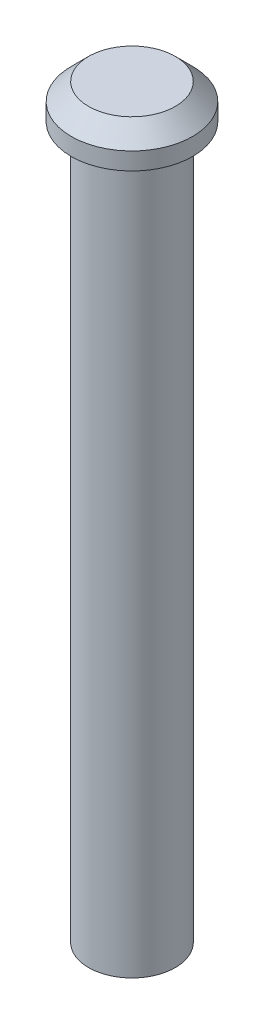
ISO-10303-21;
HEADER;
FILE_DESCRIPTION(('STEP AP214'),'2;1');
FILE_NAME('part.step','',(''),(''),'','','');
FILE_SCHEMA(('AUTOMOTIVE_DESIGN { 1 0 10303 214 1 1 1 1 }'));
ENDSEC;
DATA;
#1=APPLICATION_CONTEXT('core data for automotive mechanical design processes');
#2=APPLICATION_PROTOCOL_DEFINITION('international standard','automotive_design',2000,#1);
#3=PRODUCT_CONTEXT('',#1,'mechanical');
#4=PRODUCT('Part','Part','',(#3));
#5=PRODUCT_RELATED_PRODUCT_CATEGORY('part','',(#4));
#6=PRODUCT_DEFINITION_FORMATION('','',#4);
#7=PRODUCT_DEFINITION_CONTEXT('part definition',#1,'design');
#8=PRODUCT_DEFINITION('design','',#6,#7);
#9=PRODUCT_DEFINITION_SHAPE('','',#8);
#10=(LENGTH_UNIT() NAMED_UNIT(*) SI_UNIT(.MILLI.,.METRE.));
#11=(NAMED_UNIT(*) PLANE_ANGLE_UNIT() SI_UNIT($,.RADIAN.));
#12=(NAMED_UNIT(*) SI_UNIT($,.STERADIAN.) SOLID_ANGLE_UNIT());
#13=UNCERTAINTY_MEASURE_WITH_UNIT(LENGTH_MEASURE(1.E-05),#10,'distance_accuracy_value','');
#14=(GEOMETRIC_REPRESENTATION_CONTEXT(3) GLOBAL_UNCERTAINTY_ASSIGNED_CONTEXT((#13)) GLOBAL_UNIT_ASSIGNED_CONTEXT((#10,
#11,#12)) REPRESENTATION_CONTEXT('',''));
#15=CARTESIAN_POINT('',(0.,0.,0.));
#16=DIRECTION('',(0.,0.,1.));
#17=DIRECTION('',(1.,0.,0.));
#18=AXIS2_PLACEMENT_3D('',#15,#16,#17);
#19=CARTESIAN_POINT('',(0.,41.,0.));
#20=DIRECTION('',(0.,-1.,0.));
#21=DIRECTION('',(0.,0.,-1.));
#22=AXIS2_PLACEMENT_3D('',#19,#20,#21);
#23=CYLINDRICAL_SURFACE('',#22,2.5);
#24=CARTESIAN_POINT('',(0.,41.,0.));
#25=DIRECTION('',(0.,1.,0.));
#26=DIRECTION('',(0.,0.,1.));
#27=AXIS2_PLACEMENT_3D('',#24,#25,#26);
#28=CIRCLE('',#27,2.5);
#29=CARTESIAN_POINT('',(0.,41.,2.5));
#30=VERTEX_POINT('',#29);
#31=EDGE_CURVE('E53',#30,#30,#28,.T.);
#32=ORIENTED_EDGE('',*,*,#31,.F.);
#33=EDGE_LOOP('',(#32));
#34=FACE_BOUND('',#33,.T.);
#35=CARTESIAN_POINT('',(0.,0.,0.));
#36=DIRECTION('',(0.,1.,0.));
#37=DIRECTION('',(0.,0.,1.));
#38=AXIS2_PLACEMENT_3D('',#35,#36,#37);
#39=CIRCLE('',#38,2.5);
#40=CARTESIAN_POINT('',(0.,0.,2.5));
#41=VERTEX_POINT('',#40);
#42=EDGE_CURVE('E58',#41,#41,#39,.T.);
#43=ORIENTED_EDGE('',*,*,#42,.T.);
#44=EDGE_LOOP('',(#43));
#45=FACE_BOUND('',#44,.T.);
#46=ADVANCED_FACE('F39',(#34,#45),#23,.T.);
#47=CARTESIAN_POINT('',(0.,0.,0.));
#48=DIRECTION('',(0.,1.,0.));
#49=DIRECTION('',(0.,0.,1.));
#50=AXIS2_PLACEMENT_3D('',#47,#48,#49);
#51=PLANE('',#50);
#52=CARTESIAN_POINT('',(0.,0.,0.));
#53=DIRECTION('',(0.,-1.,0.));
#54=DIRECTION('',(0.,0.,-1.));
#55=AXIS2_PLACEMENT_3D('',#52,#53,#54);
#56=CIRCLE('',#55,1.5);
#57=CARTESIAN_POINT('',(0.,0.,-1.5));
#58=VERTEX_POINT('',#57);
#59=EDGE_CURVE('E69',#58,#58,#56,.T.);
#60=ORIENTED_EDGE('',*,*,#59,.F.);
#61=EDGE_LOOP('',(#60));
#62=FACE_BOUND('',#61,.T.);
#63=ORIENTED_EDGE('',*,*,#42,.F.);
#64=EDGE_LOOP('',(#63));
#65=FACE_BOUND('',#64,.T.);
#66=ADVANCED_FACE('F85',(#62,#65),#51,.F.);
#67=CARTESIAN_POINT('',(0.,43.,0.));
#68=DIRECTION('',(0.,-1.,0.));
#69=DIRECTION('',(0.,0.,-1.));
#70=AXIS2_PLACEMENT_3D('',#67,#68,#69);
#71=CYLINDRICAL_SURFACE('',#70,3.5);
#72=CARTESIAN_POINT('',(0.,42.,0.));
#73=DIRECTION('',(0.,1.,0.));
#74=DIRECTION('',(0.,0.,1.));
#75=AXIS2_PLACEMENT_3D('',#72,#73,#74);
#76=CIRCLE('',#75,3.5);
#77=CARTESIAN_POINT('',(0.,42.,3.5));
#78=VERTEX_POINT('',#77);
#79=EDGE_CURVE('E10',#78,#78,#76,.F.);
#80=ORIENTED_EDGE('',*,*,#79,.T.);
#81=EDGE_LOOP('',(#80));
#82=FACE_BOUND('',#81,.T.);
#83=CARTESIAN_POINT('',(0.,41.,0.));
#84=DIRECTION('',(0.,1.,0.));
#85=DIRECTION('',(0.,0.,1.));
#86=AXIS2_PLACEMENT_3D('',#83,#84,#85);
#87=CIRCLE('',#86,3.5);
#88=CARTESIAN_POINT('',(0.,41.,3.5));
#89=VERTEX_POINT('',#88);
#90=EDGE_CURVE('E63',#89,#89,#87,.T.);
#91=ORIENTED_EDGE('',*,*,#90,.T.);
#92=EDGE_LOOP('',(#91));
#93=FACE_BOUND('',#92,.T.);
#94=ADVANCED_FACE('F88',(#82,#93),#71,.T.);
#95=CARTESIAN_POINT('',(0.,43.,0.));
#96=DIRECTION('',(0.,1.,0.));
#97=DIRECTION('',(0.,0.,1.));
#98=AXIS2_PLACEMENT_3D('',#95,#96,#97);
#99=PLANE('',#98);
#100=CARTESIAN_POINT('',(0.,43.,0.));
#101=DIRECTION('',(0.,1.,0.));
#102=DIRECTION('',(0.,0.,1.));
#103=AXIS2_PLACEMENT_3D('',#100,#101,#102);
#104=CIRCLE('',#103,2.5);
#105=CARTESIAN_POINT('',(0.,43.,2.5));
#106=VERTEX_POINT('',#105);
#107=EDGE_CURVE('E48',#106,#106,#104,.T.);
#108=ORIENTED_EDGE('',*,*,#107,.T.);
#109=EDGE_LOOP('',(#108));
#110=FACE_BOUND('',#109,.T.);
#111=ADVANCED_FACE('F100',(#110),#99,.T.);
#112=CARTESIAN_POINT('',(0.,41.,0.));
#113=DIRECTION('',(0.,1.,0.));
#114=DIRECTION('',(0.,0.,1.));
#115=AXIS2_PLACEMENT_3D('',#112,#113,#114);
#116=PLANE('',#115);
#117=ORIENTED_EDGE('',*,*,#31,.T.);
#118=EDGE_LOOP('',(#117));
#119=FACE_BOUND('',#118,.T.);
#120=ORIENTED_EDGE('',*,*,#90,.F.);
#121=EDGE_LOOP('',(#120));
#122=FACE_BOUND('',#121,.T.);
#123=ADVANCED_FACE('F101',(#119,#122),#116,.F.);
#124=CARTESIAN_POINT('',(0.,43.,0.));
#125=DIRECTION('',(0.,-1.,0.));
#126=DIRECTION('',(0.,0.,-1.));
#127=AXIS2_PLACEMENT_3D('',#124,#125,#126);
#128=CONICAL_SURFACE('',#127,2.5,0.78539816339745);
#129=ORIENTED_EDGE('',*,*,#79,.F.);
#130=EDGE_LOOP('',(#129));
#131=FACE_BOUND('',#130,.T.);
#132=ORIENTED_EDGE('',*,*,#107,.F.);
#133=EDGE_LOOP('',(#132));
#134=FACE_BOUND('',#133,.T.);
#135=ADVANCED_FACE('F42',(#131,#134),#128,.T.);
#136=CARTESIAN_POINT('',(0.,5.,0.));
#137=DIRECTION('',(0.,-1.,0.));
#138=DIRECTION('',(0.,0.,-1.));
#139=AXIS2_PLACEMENT_3D('',#136,#137,#138);
#140=CYLINDRICAL_SURFACE('',#139,1.5);
#141=CARTESIAN_POINT('',(0.,5.,0.));
#142=DIRECTION('',(0.,-1.,0.));
#143=DIRECTION('',(0.,0.,-1.));
#144=AXIS2_PLACEMENT_3D('',#141,#142,#143);
#145=CIRCLE('',#144,1.5);
#146=CARTESIAN_POINT('',(0.,5.,-1.5));
#147=VERTEX_POINT('',#146);
#148=EDGE_CURVE('E68',#147,#147,#145,.T.);
#149=ORIENTED_EDGE('',*,*,#148,.F.);
#150=EDGE_LOOP('',(#149));
#151=FACE_BOUND('',#150,.T.);
#152=ORIENTED_EDGE('',*,*,#59,.T.);
#153=EDGE_LOOP('',(#152));
#154=FACE_BOUND('',#153,.T.);
#155=ADVANCED_FACE('F79',(#151,#154),#140,.F.);
#156=CARTESIAN_POINT('',(0.,5.,0.));
#157=DIRECTION('',(0.,-1.,0.));
#158=DIRECTION('',(0.,0.,-1.));
#159=AXIS2_PLACEMENT_3D('',#156,#157,#158);
#160=PLANE('',#159);
#161=ORIENTED_EDGE('',*,*,#148,.T.);
#162=EDGE_LOOP('',(#161));
#163=FACE_BOUND('',#162,.T.);
#164=ADVANCED_FACE('F77',(#163),#160,.T.);
#165=CLOSED_SHELL('',(#46,#66,#94,#111,#123,#135,#155,#164));
#166=MANIFOLD_SOLID_BREP('B2',#165);
#167=ADVANCED_BREP_SHAPE_REPRESENTATION('',(#18,#166),#14);
#168=SHAPE_DEFINITION_REPRESENTATION(#9,#167);
ENDSEC;
END-ISO-10303-21;
